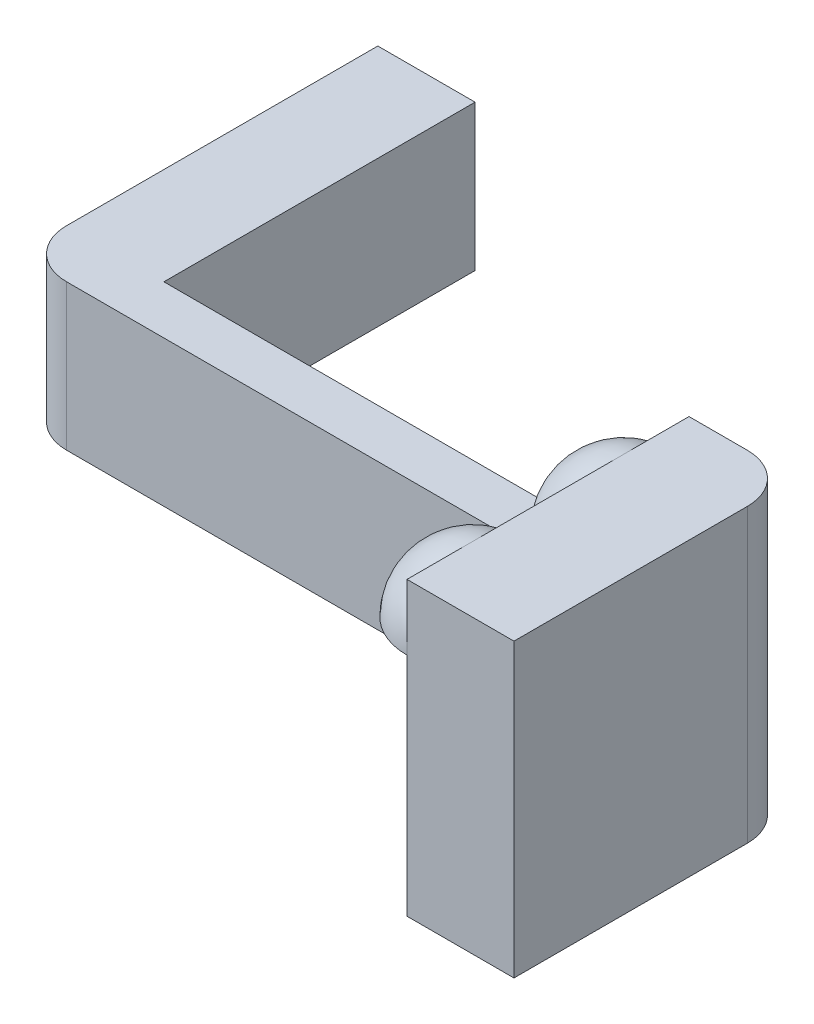
ISO-10303-21;
HEADER;
FILE_DESCRIPTION(('STEP AP214'),'2;1');
FILE_NAME('part.step','',(''),(''),'','','');
FILE_SCHEMA(('AUTOMOTIVE_DESIGN { 1 0 10303 214 1 1 1 1 }'));
ENDSEC;
DATA;
#1=APPLICATION_CONTEXT('core data for automotive mechanical design processes');
#2=APPLICATION_PROTOCOL_DEFINITION('international standard','automotive_design',2000,#1);
#3=PRODUCT_CONTEXT('',#1,'mechanical');
#4=PRODUCT('Part','Part','',(#3));
#5=PRODUCT_RELATED_PRODUCT_CATEGORY('part','',(#4));
#6=PRODUCT_DEFINITION_FORMATION('','',#4);
#7=PRODUCT_DEFINITION_CONTEXT('part definition',#1,'design');
#8=PRODUCT_DEFINITION('design','',#6,#7);
#9=PRODUCT_DEFINITION_SHAPE('','',#8);
#10=(LENGTH_UNIT() NAMED_UNIT(*) SI_UNIT(.MILLI.,.METRE.));
#11=(NAMED_UNIT(*) PLANE_ANGLE_UNIT() SI_UNIT($,.RADIAN.));
#12=(NAMED_UNIT(*) SI_UNIT($,.STERADIAN.) SOLID_ANGLE_UNIT());
#13=UNCERTAINTY_MEASURE_WITH_UNIT(LENGTH_MEASURE(1.E-05),#10,'distance_accuracy_value','');
#14=(GEOMETRIC_REPRESENTATION_CONTEXT(3) GLOBAL_UNCERTAINTY_ASSIGNED_CONTEXT((#13)) GLOBAL_UNIT_ASSIGNED_CONTEXT((#10,
#11,#12)) REPRESENTATION_CONTEXT('',''));
#15=CARTESIAN_POINT('',(0.,0.,0.));
#16=DIRECTION('',(0.,0.,1.));
#17=DIRECTION('',(1.,0.,0.));
#18=AXIS2_PLACEMENT_3D('',#15,#16,#17);
#19=CARTESIAN_POINT('',(24.,22.5,59.5941170815567));
#20=DIRECTION('',(1.,0.,0.));
#21=DIRECTION('',(0.,1.,0.));
#22=AXIS2_PLACEMENT_3D('',#19,#20,#21);
#23=PLANE('',#22);
#24=CARTESIAN_POINT('',(24.,15.75,6.75));
#25=DIRECTION('',(-1.,0.,0.));
#26=DIRECTION('',(0.,-1.,0.));
#27=AXIS2_PLACEMENT_3D('',#24,#25,#26);
#28=CIRCLE('',#27,6.75);
#29=CARTESIAN_POINT('',(24.,22.5,6.75));
#30=VERTEX_POINT('',#29);
#31=CARTESIAN_POINT('',(24.,15.75,0.));
#32=VERTEX_POINT('',#31);
#33=EDGE_CURVE('E196',#30,#32,#28,.T.);
#34=ORIENTED_EDGE('',*,*,#33,.F.);
#35=DIRECTION('',(0.,0.,-1.));
#36=VECTOR('',#35,1.);
#37=CARTESIAN_POINT('',(24.,22.5,59.5941170815567));
#38=LINE('',#37,#36);
#39=CARTESIAN_POINT('',(24.,22.5,0.));
#40=VERTEX_POINT('',#39);
#41=EDGE_CURVE('E330',#30,#40,#38,.T.);
#42=ORIENTED_EDGE('',*,*,#41,.T.);
#43=DIRECTION('',(0.,-1.,0.));
#44=VECTOR('',#43,1.);
#45=CARTESIAN_POINT('',(24.,22.5,0.));
#46=LINE('',#45,#44);
#47=EDGE_CURVE('E316',#40,#32,#46,.T.);
#48=ORIENTED_EDGE('',*,*,#47,.T.);
#49=EDGE_LOOP('',(#34,#42,#48));
#50=FACE_BOUND('',#49,.T.);
#51=ADVANCED_FACE('F45',(#50),#23,.F.);
#52=CARTESIAN_POINT('',(24.,15.75,13.5));
#53=VERTEX_POINT('',#52);
#54=EDGE_CURVE('E194',#53,#30,#28,.T.);
#55=ORIENTED_EDGE('',*,*,#54,.F.);
#56=DIRECTION('',(0.,0.,1.));
#57=VECTOR('',#56,1.);
#58=CARTESIAN_POINT('',(24.,15.75,0.));
#59=LINE('',#58,#57);
#60=EDGE_CURVE('E199',#32,#53,#59,.T.);
#61=ORIENTED_EDGE('',*,*,#60,.F.);
#62=CARTESIAN_POINT('',(24.,7.5,0.));
#63=VERTEX_POINT('',#62);
#64=EDGE_CURVE('E315',#32,#63,#46,.T.);
#65=ORIENTED_EDGE('',*,*,#64,.T.);
#66=DIRECTION('',(0.,0.,1.));
#67=VECTOR('',#66,1.);
#68=CARTESIAN_POINT('',(24.,7.5,5.));
#69=LINE('',#68,#67);
#70=CARTESIAN_POINT('',(24.,7.5,5.));
#71=VERTEX_POINT('',#70);
#72=EDGE_CURVE('E337',#63,#71,#69,.T.);
#73=ORIENTED_EDGE('',*,*,#72,.T.);
#74=DIRECTION('',(0.,-1.,0.));
#75=VECTOR('',#74,1.);
#76=CARTESIAN_POINT('',(24.,0.,5.));
#77=LINE('',#76,#75);
#78=CARTESIAN_POINT('',(24.,-7.5,5.00000000000001));
#79=VERTEX_POINT('',#78);
#80=EDGE_CURVE('E325',#71,#79,#77,.T.);
#81=ORIENTED_EDGE('',*,*,#80,.T.);
#82=DIRECTION('',(0.,0.,-1.));
#83=VECTOR('',#82,1.);
#84=CARTESIAN_POINT('',(24.,-7.5,59.5941170815567));
#85=LINE('',#84,#83);
#86=CARTESIAN_POINT('',(24.,-7.5,29.));
#87=VERTEX_POINT('',#86);
#88=EDGE_CURVE('E320',#87,#79,#85,.T.);
#89=ORIENTED_EDGE('',*,*,#88,.F.);
#90=DIRECTION('',(0.,1.,0.));
#91=VECTOR('',#90,1.);
#92=CARTESIAN_POINT('',(24.,22.5,29.));
#93=LINE('',#92,#91);
#94=CARTESIAN_POINT('',(24.,15.75,29.));
#95=VERTEX_POINT('',#94);
#96=EDGE_CURVE('E321',#87,#95,#93,.T.);
#97=ORIENTED_EDGE('',*,*,#96,.T.);
#98=DIRECTION('',(0.,0.,1.));
#99=VECTOR('',#98,1.);
#100=CARTESIAN_POINT('',(24.,15.75,0.));
#101=LINE('',#100,#99);
#102=CARTESIAN_POINT('',(24.,15.75,15.5));
#103=VERTEX_POINT('',#102);
#104=EDGE_CURVE('E216',#103,#95,#101,.T.);
#105=ORIENTED_EDGE('',*,*,#104,.F.);
#106=CARTESIAN_POINT('',(24.,15.75,22.25));
#107=DIRECTION('',(1.,0.,0.));
#108=DIRECTION('',(0.,1.,0.));
#109=AXIS2_PLACEMENT_3D('',#106,#107,#108);
#110=CIRCLE('',#109,6.75);
#111=CARTESIAN_POINT('',(24.,22.5,22.25));
#112=VERTEX_POINT('',#111);
#113=EDGE_CURVE('E11',#112,#103,#110,.F.);
#114=ORIENTED_EDGE('',*,*,#113,.F.);
#115=EDGE_CURVE('E210',#112,#30,#38,.T.);
#116=ORIENTED_EDGE('',*,*,#115,.T.);
#117=EDGE_LOOP('',(#55,#61,#65,#73,#81,#89,#97,#105,#114,#116));
#118=FACE_BOUND('',#117,.T.);
#119=ADVANCED_FACE('F207',(#118),#23,.F.);
#120=CARTESIAN_POINT('',(24.,15.75,22.25));
#121=DIRECTION('',(-1.,0.,0.));
#122=DIRECTION('',(0.,-1.,0.));
#123=AXIS2_PLACEMENT_3D('',#120,#121,#122);
#124=CIRCLE('',#123,6.75);
#125=EDGE_CURVE('E212',#95,#112,#124,.T.);
#126=ORIENTED_EDGE('',*,*,#125,.F.);
#127=CARTESIAN_POINT('',(24.,22.5,29.));
#128=VERTEX_POINT('',#127);
#129=EDGE_CURVE('E326',#95,#128,#93,.T.);
#130=ORIENTED_EDGE('',*,*,#129,.T.);
#131=EDGE_CURVE('E331',#128,#112,#38,.T.);
#132=ORIENTED_EDGE('',*,*,#131,.T.);
#133=EDGE_LOOP('',(#126,#130,#132));
#134=FACE_BOUND('',#133,.T.);
#135=ADVANCED_FACE('F485',(#134),#23,.F.);
#136=CARTESIAN_POINT('',(30.,7.5,5.));
#137=DIRECTION('',(0.,-1.,0.));
#138=DIRECTION('',(1.,0.,0.));
#139=AXIS2_PLACEMENT_3D('',#136,#137,#138);
#140=PLANE('',#139);
#141=ORIENTED_EDGE('',*,*,#72,.F.);
#142=DIRECTION('',(-1.,0.,0.));
#143=VECTOR('',#142,1.);
#144=CARTESIAN_POINT('',(30.,7.5,0.));
#145=LINE('',#144,#143);
#146=CARTESIAN_POINT('',(-30.,7.5,0.));
#147=VERTEX_POINT('',#146);
#148=EDGE_CURVE('E395',#63,#147,#145,.T.);
#149=ORIENTED_EDGE('',*,*,#148,.T.);
#150=DIRECTION('',(0.,0.,-1.));
#151=VECTOR('',#150,1.);
#152=CARTESIAN_POINT('',(-30.,7.5,5.));
#153=LINE('',#152,#151);
#154=CARTESIAN_POINT('',(-30.,7.49999999999999,-32.));
#155=VERTEX_POINT('',#154);
#156=EDGE_CURVE('E361',#147,#155,#153,.T.);
#157=ORIENTED_EDGE('',*,*,#156,.T.);
#158=DIRECTION('',(1.,0.,0.));
#159=VECTOR('',#158,1.);
#160=CARTESIAN_POINT('',(-40.,7.49999999999999,-32.));
#161=LINE('',#160,#159);
#162=CARTESIAN_POINT('',(-40.,7.49999999999999,-32.));
#163=VERTEX_POINT('',#162);
#164=EDGE_CURVE('E385',#163,#155,#161,.T.);
#165=ORIENTED_EDGE('',*,*,#164,.F.);
#166=DIRECTION('',(0.,0.,-1.));
#167=VECTOR('',#166,1.);
#168=CARTESIAN_POINT('',(-40.,7.5,5.));
#169=LINE('',#168,#167);
#170=CARTESIAN_POINT('',(-40.,7.5,0.));
#171=VERTEX_POINT('',#170);
#172=EDGE_CURVE('E362',#171,#163,#169,.T.);
#173=ORIENTED_EDGE('',*,*,#172,.F.);
#174=CARTESIAN_POINT('',(-35.,7.5,0.));
#175=DIRECTION('',(0.,-1.,0.));
#176=DIRECTION('',(1.,0.,0.));
#177=AXIS2_PLACEMENT_3D('',#174,#175,#176);
#178=CIRCLE('',#177,5.);
#179=CARTESIAN_POINT('',(-35.,7.5,5.));
#180=VERTEX_POINT('',#179);
#181=EDGE_CURVE('E410',#171,#180,#178,.F.);
#182=ORIENTED_EDGE('',*,*,#181,.T.);
#183=DIRECTION('',(-1.,0.,0.));
#184=VECTOR('',#183,1.);
#185=CARTESIAN_POINT('',(30.,7.5,5.));
#186=LINE('',#185,#184);
#187=EDGE_CURVE('E394',#71,#180,#186,.T.);
#188=ORIENTED_EDGE('',*,*,#187,.F.);
#189=EDGE_LOOP('',(#141,#149,#157,#165,#173,#182,#188));
#190=FACE_BOUND('',#189,.T.);
#191=ADVANCED_FACE('F509',(#190),#140,.F.);
#192=CARTESIAN_POINT('',(0.,0.,5.));
#193=DIRECTION('',(0.,0.,-1.));
#194=DIRECTION('',(-1.,0.,0.));
#195=AXIS2_PLACEMENT_3D('',#192,#193,#194);
#196=PLANE('',#195);
#197=ORIENTED_EDGE('',*,*,#80,.F.);
#198=ORIENTED_EDGE('',*,*,#187,.T.);
#199=DIRECTION('',(0.,1.,0.));
#200=VECTOR('',#199,1.);
#201=CARTESIAN_POINT('',(-35.,0.,5.));
#202=LINE('',#201,#200);
#203=CARTESIAN_POINT('',(-35.,-7.5,5.));
#204=VERTEX_POINT('',#203);
#205=EDGE_CURVE('E414',#180,#204,#202,.F.);
#206=ORIENTED_EDGE('',*,*,#205,.T.);
#207=DIRECTION('',(1.,0.,0.));
#208=VECTOR('',#207,1.);
#209=CARTESIAN_POINT('',(30.,-7.5,5.));
#210=LINE('',#209,#208);
#211=EDGE_CURVE('E390',#204,#79,#210,.T.);
#212=ORIENTED_EDGE('',*,*,#211,.T.);
#213=EDGE_LOOP('',(#197,#198,#206,#212));
#214=FACE_BOUND('',#213,.T.);
#215=ADVANCED_FACE('F454',(#214),#196,.F.);
#216=CARTESIAN_POINT('',(30.,-7.5,5.));
#217=DIRECTION('',(0.,1.,0.));
#218=DIRECTION('',(-1.,0.,0.));
#219=AXIS2_PLACEMENT_3D('',#216,#217,#218);
#220=PLANE('',#219);
#221=DIRECTION('',(1.,0.,0.));
#222=VECTOR('',#221,1.);
#223=CARTESIAN_POINT('',(33.,-7.5,5.));
#224=LINE('',#223,#222);
#225=CARTESIAN_POINT('',(27.,-7.5,5.));
#226=VERTEX_POINT('',#225);
#227=CARTESIAN_POINT('',(33.,-7.5,5.));
#228=VERTEX_POINT('',#227);
#229=EDGE_CURVE('E245',#226,#228,#224,.T.);
#230=ORIENTED_EDGE('',*,*,#229,.F.);
#231=DIRECTION('',(0.,0.,-1.));
#232=VECTOR('',#231,1.);
#233=CARTESIAN_POINT('',(27.,-7.5,27.));
#234=LINE('',#233,#232);
#235=CARTESIAN_POINT('',(27.,-7.5,27.));
#236=VERTEX_POINT('',#235);
#237=EDGE_CURVE('E242',#236,#226,#234,.T.);
#238=ORIENTED_EDGE('',*,*,#237,.F.);
#239=DIRECTION('',(-1.,0.,0.));
#240=VECTOR('',#239,1.);
#241=CARTESIAN_POINT('',(33.,-7.5,27.));
#242=LINE('',#241,#240);
#243=CARTESIAN_POINT('',(33.,-7.5,27.));
#244=VERTEX_POINT('',#243);
#245=EDGE_CURVE('E229',#244,#236,#242,.T.);
#246=ORIENTED_EDGE('',*,*,#245,.F.);
#247=DIRECTION('',(0.,0.,1.));
#248=VECTOR('',#247,1.);
#249=CARTESIAN_POINT('',(33.,-7.5,27.));
#250=LINE('',#249,#248);
#251=EDGE_CURVE('E250',#228,#244,#250,.T.);
#252=ORIENTED_EDGE('',*,*,#251,.F.);
#253=EDGE_LOOP('',(#230,#238,#246,#252));
#254=FACE_BOUND('',#253,.T.);
#255=DIRECTION('',(1.,0.,0.));
#256=VECTOR('',#255,1.);
#257=CARTESIAN_POINT('',(-32.,-7.5,-27.));
#258=LINE('',#257,#256);
#259=CARTESIAN_POINT('',(-38.,-7.5,-27.));
#260=VERTEX_POINT('',#259);
#261=CARTESIAN_POINT('',(-32.,-7.5,-27.));
#262=VERTEX_POINT('',#261);
#263=EDGE_CURVE('E292',#260,#262,#258,.T.);
#264=ORIENTED_EDGE('',*,*,#263,.F.);
#265=DIRECTION('',(0.,0.,-1.));
#266=VECTOR('',#265,1.);
#267=CARTESIAN_POINT('',(-38.,-7.5,-5.));
#268=LINE('',#267,#266);
#269=CARTESIAN_POINT('',(-38.,-7.5,-5.));
#270=VERTEX_POINT('',#269);
#271=EDGE_CURVE('E246',#270,#260,#268,.T.);
#272=ORIENTED_EDGE('',*,*,#271,.F.);
#273=DIRECTION('',(-1.,0.,0.));
#274=VECTOR('',#273,1.);
#275=CARTESIAN_POINT('',(-32.,-7.5,-5.));
#276=LINE('',#275,#274);
#277=CARTESIAN_POINT('',(-32.,-7.5,-5.));
#278=VERTEX_POINT('',#277);
#279=EDGE_CURVE('E283',#278,#270,#276,.T.);
#280=ORIENTED_EDGE('',*,*,#279,.F.);
#281=DIRECTION('',(0.,0.,1.));
#282=VECTOR('',#281,1.);
#283=CARTESIAN_POINT('',(-32.,-7.5,-5.));
#284=LINE('',#283,#282);
#285=EDGE_CURVE('E287',#262,#278,#284,.T.);
#286=ORIENTED_EDGE('',*,*,#285,.F.);
#287=EDGE_LOOP('',(#264,#272,#280,#286));
#288=FACE_BOUND('',#287,.T.);
#289=DIRECTION('',(1.,0.,0.));
#290=VECTOR('',#289,1.);
#291=CARTESIAN_POINT('',(30.,-7.5,0.));
#292=LINE('',#291,#290);
#293=CARTESIAN_POINT('',(-30.,-7.50000000000001,0.));
#294=VERTEX_POINT('',#293);
#295=CARTESIAN_POINT('',(30.,-7.5,0.));
#296=VERTEX_POINT('',#295);
#297=EDGE_CURVE('E402',#294,#296,#292,.T.);
#298=ORIENTED_EDGE('',*,*,#297,.T.);
#299=CARTESIAN_POINT('',(30.,-7.5,5.));
#300=DIRECTION('',(0.,1.,0.));
#301=DIRECTION('',(-1.,0.,0.));
#302=AXIS2_PLACEMENT_3D('',#299,#300,#301);
#303=CIRCLE('',#302,5.);
#304=CARTESIAN_POINT('',(35.,-7.5,5.));
#305=VERTEX_POINT('',#304);
#306=EDGE_CURVE('E54',#296,#305,#303,.F.);
#307=ORIENTED_EDGE('',*,*,#306,.T.);
#308=DIRECTION('',(0.,0.,-1.));
#309=VECTOR('',#308,1.);
#310=CARTESIAN_POINT('',(35.,-7.5,0.));
#311=LINE('',#310,#309);
#312=CARTESIAN_POINT('',(35.,-7.50000000000001,29.));
#313=VERTEX_POINT('',#312);
#314=EDGE_CURVE('E347',#313,#305,#311,.T.);
#315=ORIENTED_EDGE('',*,*,#314,.F.);
#316=DIRECTION('',(-1.,0.,0.));
#317=VECTOR('',#316,1.);
#318=CARTESIAN_POINT('',(35.,-7.50000000000001,29.));
#319=LINE('',#318,#317);
#320=EDGE_CURVE('E351',#313,#87,#319,.T.);
#321=ORIENTED_EDGE('',*,*,#320,.T.);
#322=ORIENTED_EDGE('',*,*,#88,.T.);
#323=ORIENTED_EDGE('',*,*,#211,.F.);
#324=CARTESIAN_POINT('',(-35.,-7.5,0.));
#325=DIRECTION('',(0.,1.,0.));
#326=DIRECTION('',(-1.,0.,0.));
#327=AXIS2_PLACEMENT_3D('',#324,#325,#326);
#328=CIRCLE('',#327,5.);
#329=CARTESIAN_POINT('',(-40.,-7.50000000000001,0.));
#330=VERTEX_POINT('',#329);
#331=EDGE_CURVE('E417',#204,#330,#328,.F.);
#332=ORIENTED_EDGE('',*,*,#331,.T.);
#333=DIRECTION('',(0.,0.,1.));
#334=VECTOR('',#333,1.);
#335=CARTESIAN_POINT('',(-40.,-7.50000000000001,5.));
#336=LINE('',#335,#334);
#337=CARTESIAN_POINT('',(-40.,-7.50000000000001,-32.));
#338=VERTEX_POINT('',#337);
#339=EDGE_CURVE('E369',#338,#330,#336,.T.);
#340=ORIENTED_EDGE('',*,*,#339,.F.);
#341=DIRECTION('',(1.,0.,0.));
#342=VECTOR('',#341,1.);
#343=CARTESIAN_POINT('',(-40.,-7.50000000000001,-32.));
#344=LINE('',#343,#342);
#345=CARTESIAN_POINT('',(-30.,-7.50000000000001,-32.));
#346=VERTEX_POINT('',#345);
#347=EDGE_CURVE('E373',#338,#346,#344,.T.);
#348=ORIENTED_EDGE('',*,*,#347,.T.);
#349=DIRECTION('',(0.,0.,1.));
#350=VECTOR('',#349,1.);
#351=CARTESIAN_POINT('',(-30.,-7.50000000000001,5.));
#352=LINE('',#351,#350);
#353=EDGE_CURVE('E366',#346,#294,#352,.T.);
#354=ORIENTED_EDGE('',*,*,#353,.T.);
#355=EDGE_LOOP('',(#298,#307,#315,#321,#322,#323,#332,#340,#348,#354));
#356=FACE_BOUND('',#355,.T.);
#357=ADVANCED_FACE('F431',(#254,#288,#356),#220,.F.);
#358=CARTESIAN_POINT('',(0.,0.,0.));
#359=DIRECTION('',(0.,0.,-1.));
#360=DIRECTION('',(-1.,0.,0.));
#361=AXIS2_PLACEMENT_3D('',#358,#359,#360);
#362=PLANE('',#361);
#363=DIRECTION('',(0.,1.,0.));
#364=VECTOR('',#363,1.);
#365=CARTESIAN_POINT('',(30.,22.5,0.));
#366=LINE('',#365,#364);
#367=CARTESIAN_POINT('',(30.,22.5,0.));
#368=VERTEX_POINT('',#367);
#369=EDGE_CURVE('E340',#296,#368,#366,.T.);
#370=ORIENTED_EDGE('',*,*,#369,.F.);
#371=ORIENTED_EDGE('',*,*,#297,.F.);
#372=DIRECTION('',(0.,-1.,0.));
#373=VECTOR('',#372,1.);
#374=CARTESIAN_POINT('',(-30.,7.5,0.));
#375=LINE('',#374,#373);
#376=EDGE_CURVE('E389',#147,#294,#375,.T.);
#377=ORIENTED_EDGE('',*,*,#376,.F.);
#378=ORIENTED_EDGE('',*,*,#148,.F.);
#379=ORIENTED_EDGE('',*,*,#64,.F.);
#380=ORIENTED_EDGE('',*,*,#47,.F.);
#381=DIRECTION('',(-1.,0.,0.));
#382=VECTOR('',#381,1.);
#383=CARTESIAN_POINT('',(30.,22.5,0.));
#384=LINE('',#383,#382);
#385=EDGE_CURVE('E260',#368,#40,#384,.T.);
#386=ORIENTED_EDGE('',*,*,#385,.F.);
#387=EDGE_LOOP('',(#370,#371,#377,#378,#379,#380,#386));
#388=FACE_BOUND('',#387,.T.);
#389=ADVANCED_FACE('F477',(#388),#362,.T.);
#390=CARTESIAN_POINT('',(-40.,7.49999999999999,-32.));
#391=DIRECTION('',(0.,0.,1.));
#392=DIRECTION('',(1.,0.,0.));
#393=AXIS2_PLACEMENT_3D('',#390,#391,#392);
#394=PLANE('',#393);
#395=DIRECTION('',(0.,-1.,0.));
#396=VECTOR('',#395,1.);
#397=CARTESIAN_POINT('',(-30.,7.49999999999999,-32.));
#398=LINE('',#397,#396);
#399=EDGE_CURVE('E376',#155,#346,#398,.T.);
#400=ORIENTED_EDGE('',*,*,#399,.T.);
#401=ORIENTED_EDGE('',*,*,#347,.F.);
#402=DIRECTION('',(0.,-1.,0.));
#403=VECTOR('',#402,1.);
#404=CARTESIAN_POINT('',(-40.,7.49999999999999,-32.));
#405=LINE('',#404,#403);
#406=EDGE_CURVE('E365',#163,#338,#405,.T.);
#407=ORIENTED_EDGE('',*,*,#406,.F.);
#408=ORIENTED_EDGE('',*,*,#164,.T.);
#409=EDGE_LOOP('',(#400,#401,#407,#408));
#410=FACE_BOUND('',#409,.T.);
#411=ADVANCED_FACE('F468',(#410),#394,.F.);
#412=CARTESIAN_POINT('',(-40.,0.,0.));
#413=DIRECTION('',(1.,0.,0.));
#414=DIRECTION('',(0.,0.,-1.));
#415=AXIS2_PLACEMENT_3D('',#412,#413,#414);
#416=PLANE('',#415);
#417=ORIENTED_EDGE('',*,*,#339,.T.);
#418=DIRECTION('',(0.,1.,0.));
#419=VECTOR('',#418,1.);
#420=CARTESIAN_POINT('',(-40.,0.,0.));
#421=LINE('',#420,#419);
#422=EDGE_CURVE('E398',#330,#171,#421,.T.);
#423=ORIENTED_EDGE('',*,*,#422,.T.);
#424=ORIENTED_EDGE('',*,*,#172,.T.);
#425=ORIENTED_EDGE('',*,*,#406,.T.);
#426=EDGE_LOOP('',(#417,#423,#424,#425));
#427=FACE_BOUND('',#426,.T.);
#428=ADVANCED_FACE('F462',(#427),#416,.F.);
#429=CARTESIAN_POINT('',(-30.,0.,0.));
#430=DIRECTION('',(1.,0.,0.));
#431=DIRECTION('',(0.,0.,-1.));
#432=AXIS2_PLACEMENT_3D('',#429,#430,#431);
#433=PLANE('',#432);
#434=ORIENTED_EDGE('',*,*,#156,.F.);
#435=ORIENTED_EDGE('',*,*,#376,.T.);
#436=ORIENTED_EDGE('',*,*,#353,.F.);
#437=ORIENTED_EDGE('',*,*,#399,.F.);
#438=EDGE_LOOP('',(#434,#435,#436,#437));
#439=FACE_BOUND('',#438,.T.);
#440=ADVANCED_FACE('F473',(#439),#433,.T.);
#441=CARTESIAN_POINT('',(-35.,0.,0.));
#442=DIRECTION('',(0.,1.,0.));
#443=DIRECTION('',(0.,0.,1.));
#444=AXIS2_PLACEMENT_3D('',#441,#442,#443);
#445=CYLINDRICAL_SURFACE('',#444,5.);
#446=ORIENTED_EDGE('',*,*,#331,.F.);
#447=ORIENTED_EDGE('',*,*,#205,.F.);
#448=ORIENTED_EDGE('',*,*,#181,.F.);
#449=ORIENTED_EDGE('',*,*,#422,.F.);
#450=EDGE_LOOP('',(#446,#447,#448,#449));
#451=FACE_BOUND('',#450,.T.);
#452=ADVANCED_FACE('F458',(#451),#445,.T.);
#453=CARTESIAN_POINT('',(35.,22.5,0.));
#454=DIRECTION('',(0.,-1.,0.));
#455=DIRECTION('',(0.,0.,-1.));
#456=AXIS2_PLACEMENT_3D('',#453,#454,#455);
#457=PLANE('',#456);
#458=DIRECTION('',(0.,0.,1.));
#459=VECTOR('',#458,1.);
#460=CARTESIAN_POINT('',(35.,22.5,0.));
#461=LINE('',#460,#459);
#462=CARTESIAN_POINT('',(35.,22.5,5.));
#463=VERTEX_POINT('',#462);
#464=CARTESIAN_POINT('',(35.,22.5,29.));
#465=VERTEX_POINT('',#464);
#466=EDGE_CURVE('E341',#463,#465,#461,.T.);
#467=ORIENTED_EDGE('',*,*,#466,.F.);
#468=CARTESIAN_POINT('',(30.,22.5,5.));
#469=DIRECTION('',(0.,-1.,0.));
#470=DIRECTION('',(0.,0.,-1.));
#471=AXIS2_PLACEMENT_3D('',#468,#469,#470);
#472=CIRCLE('',#471,5.);
#473=EDGE_CURVE('E424',#463,#368,#472,.F.);
#474=ORIENTED_EDGE('',*,*,#473,.T.);
#475=ORIENTED_EDGE('',*,*,#385,.T.);
#476=ORIENTED_EDGE('',*,*,#41,.F.);
#477=ORIENTED_EDGE('',*,*,#115,.F.);
#478=ORIENTED_EDGE('',*,*,#131,.F.);
#479=DIRECTION('',(-1.,0.,0.));
#480=VECTOR('',#479,1.);
#481=CARTESIAN_POINT('',(35.,22.5,29.));
#482=LINE('',#481,#480);
#483=EDGE_CURVE('E357',#465,#128,#482,.T.);
#484=ORIENTED_EDGE('',*,*,#483,.F.);
#485=EDGE_LOOP('',(#467,#474,#475,#476,#477,#478,#484));
#486=FACE_BOUND('',#485,.T.);
#487=ADVANCED_FACE('F441',(#486),#457,.F.);
#488=CARTESIAN_POINT('',(35.,22.5,29.));
#489=DIRECTION('',(0.,0.,-1.));
#490=DIRECTION('',(0.,1.,0.));
#491=AXIS2_PLACEMENT_3D('',#488,#489,#490);
#492=PLANE('',#491);
#493=ORIENTED_EDGE('',*,*,#483,.T.);
#494=ORIENTED_EDGE('',*,*,#129,.F.);
#495=ORIENTED_EDGE('',*,*,#96,.F.);
#496=ORIENTED_EDGE('',*,*,#320,.F.);
#497=DIRECTION('',(0.,-1.,0.));
#498=VECTOR('',#497,1.);
#499=CARTESIAN_POINT('',(35.,22.5,29.));
#500=LINE('',#499,#498);
#501=EDGE_CURVE('E344',#465,#313,#500,.T.);
#502=ORIENTED_EDGE('',*,*,#501,.F.);
#503=EDGE_LOOP('',(#493,#494,#495,#496,#502));
#504=FACE_BOUND('',#503,.T.);
#505=ADVANCED_FACE('F447',(#504),#492,.F.);
#506=CARTESIAN_POINT('',(35.,0.,0.));
#507=DIRECTION('',(-1.,0.,0.));
#508=DIRECTION('',(0.,0.,1.));
#509=AXIS2_PLACEMENT_3D('',#506,#507,#508);
#510=PLANE('',#509);
#511=ORIENTED_EDGE('',*,*,#314,.T.);
#512=DIRECTION('',(0.,1.,0.));
#513=VECTOR('',#512,1.);
#514=CARTESIAN_POINT('',(35.,22.5,5.));
#515=LINE('',#514,#513);
#516=EDGE_CURVE('E420',#305,#463,#515,.T.);
#517=ORIENTED_EDGE('',*,*,#516,.T.);
#518=ORIENTED_EDGE('',*,*,#466,.T.);
#519=ORIENTED_EDGE('',*,*,#501,.T.);
#520=EDGE_LOOP('',(#511,#517,#518,#519));
#521=FACE_BOUND('',#520,.T.);
#522=ADVANCED_FACE('F436',(#521),#510,.F.);
#523=CARTESIAN_POINT('',(30.,0.,5.));
#524=DIRECTION('',(0.,-1.,0.));
#525=DIRECTION('',(0.,0.,-1.));
#526=AXIS2_PLACEMENT_3D('',#523,#524,#525);
#527=CYLINDRICAL_SURFACE('',#526,5.);
#528=ORIENTED_EDGE('',*,*,#306,.F.);
#529=ORIENTED_EDGE('',*,*,#369,.T.);
#530=ORIENTED_EDGE('',*,*,#473,.F.);
#531=ORIENTED_EDGE('',*,*,#516,.F.);
#532=EDGE_LOOP('',(#528,#529,#530,#531));
#533=FACE_BOUND('',#532,.T.);
#534=ADVANCED_FACE('F47',(#533),#527,.T.);
#535=CARTESIAN_POINT('',(-38.,3.5,-5.));
#536=DIRECTION('',(-1.,0.,0.));
#537=DIRECTION('',(0.,-1.,0.));
#538=AXIS2_PLACEMENT_3D('',#535,#536,#537);
#539=PLANE('',#538);
#540=ORIENTED_EDGE('',*,*,#271,.T.);
#541=DIRECTION('',(0.,-1.,0.));
#542=VECTOR('',#541,1.);
#543=CARTESIAN_POINT('',(-38.,3.5,-27.));
#544=LINE('',#543,#542);
#545=CARTESIAN_POINT('',(-38.,3.5,-27.));
#546=VERTEX_POINT('',#545);
#547=EDGE_CURVE('E270',#546,#260,#544,.T.);
#548=ORIENTED_EDGE('',*,*,#547,.F.);
#549=DIRECTION('',(0.,0.,-1.));
#550=VECTOR('',#549,1.);
#551=CARTESIAN_POINT('',(-38.,3.5,-5.));
#552=LINE('',#551,#550);
#553=CARTESIAN_POINT('',(-38.,3.5,-5.));
#554=VERTEX_POINT('',#553);
#555=EDGE_CURVE('E288',#554,#546,#552,.T.);
#556=ORIENTED_EDGE('',*,*,#555,.F.);
#557=DIRECTION('',(0.,-1.,0.));
#558=VECTOR('',#557,1.);
#559=CARTESIAN_POINT('',(-38.,3.5,-5.));
#560=LINE('',#559,#558);
#561=EDGE_CURVE('E223',#554,#270,#560,.T.);
#562=ORIENTED_EDGE('',*,*,#561,.T.);
#563=EDGE_LOOP('',(#540,#548,#556,#562));
#564=FACE_BOUND('',#563,.T.);
#565=ADVANCED_FACE('F564',(#564),#539,.F.);
#566=CARTESIAN_POINT('',(-32.,3.5,-5.));
#567=DIRECTION('',(0.,0.,1.));
#568=DIRECTION('',(1.,0.,0.));
#569=AXIS2_PLACEMENT_3D('',#566,#567,#568);
#570=PLANE('',#569);
#571=ORIENTED_EDGE('',*,*,#279,.T.);
#572=ORIENTED_EDGE('',*,*,#561,.F.);
#573=DIRECTION('',(-1.,0.,0.));
#574=VECTOR('',#573,1.);
#575=CARTESIAN_POINT('',(-32.,3.5,-5.));
#576=LINE('',#575,#574);
#577=CARTESIAN_POINT('',(-32.,3.5,-5.));
#578=VERTEX_POINT('',#577);
#579=EDGE_CURVE('E274',#578,#554,#576,.T.);
#580=ORIENTED_EDGE('',*,*,#579,.F.);
#581=DIRECTION('',(0.,-1.,0.));
#582=VECTOR('',#581,1.);
#583=CARTESIAN_POINT('',(-32.,3.5,-5.));
#584=LINE('',#583,#582);
#585=EDGE_CURVE('E278',#578,#278,#584,.T.);
#586=ORIENTED_EDGE('',*,*,#585,.T.);
#587=EDGE_LOOP('',(#571,#572,#580,#586));
#588=FACE_BOUND('',#587,.T.);
#589=ADVANCED_FACE('F576',(#588),#570,.F.);
#590=CARTESIAN_POINT('',(-32.,3.5,-5.));
#591=DIRECTION('',(1.,0.,0.));
#592=DIRECTION('',(0.,1.,0.));
#593=AXIS2_PLACEMENT_3D('',#590,#591,#592);
#594=PLANE('',#593);
#595=ORIENTED_EDGE('',*,*,#285,.T.);
#596=ORIENTED_EDGE('',*,*,#585,.F.);
#597=DIRECTION('',(0.,0.,1.));
#598=VECTOR('',#597,1.);
#599=CARTESIAN_POINT('',(-32.,3.5,-5.));
#600=LINE('',#599,#598);
#601=CARTESIAN_POINT('',(-32.,3.5,-27.));
#602=VERTEX_POINT('',#601);
#603=EDGE_CURVE('E301',#602,#578,#600,.T.);
#604=ORIENTED_EDGE('',*,*,#603,.F.);
#605=DIRECTION('',(0.,-1.,0.));
#606=VECTOR('',#605,1.);
#607=CARTESIAN_POINT('',(-32.,3.5,-27.));
#608=LINE('',#607,#606);
#609=EDGE_CURVE('E275',#602,#262,#608,.T.);
#610=ORIENTED_EDGE('',*,*,#609,.T.);
#611=EDGE_LOOP('',(#595,#596,#604,#610));
#612=FACE_BOUND('',#611,.T.);
#613=ADVANCED_FACE('F584',(#612),#594,.F.);
#614=CARTESIAN_POINT('',(-32.,3.5,-27.));
#615=DIRECTION('',(0.,0.,-1.));
#616=DIRECTION('',(-1.,0.,0.));
#617=AXIS2_PLACEMENT_3D('',#614,#615,#616);
#618=PLANE('',#617);
#619=ORIENTED_EDGE('',*,*,#263,.T.);
#620=ORIENTED_EDGE('',*,*,#609,.F.);
#621=DIRECTION('',(1.,0.,0.));
#622=VECTOR('',#621,1.);
#623=CARTESIAN_POINT('',(-32.,3.5,-27.));
#624=LINE('',#623,#622);
#625=EDGE_CURVE('E305',#546,#602,#624,.T.);
#626=ORIENTED_EDGE('',*,*,#625,.F.);
#627=ORIENTED_EDGE('',*,*,#547,.T.);
#628=EDGE_LOOP('',(#619,#620,#626,#627));
#629=FACE_BOUND('',#628,.T.);
#630=ADVANCED_FACE('F592',(#629),#618,.F.);
#631=CARTESIAN_POINT('',(0.,3.5,0.));
#632=DIRECTION('',(0.,1.,0.));
#633=DIRECTION('',(-1.,0.,0.));
#634=AXIS2_PLACEMENT_3D('',#631,#632,#633);
#635=PLANE('',#634);
#636=ORIENTED_EDGE('',*,*,#555,.T.);
#637=ORIENTED_EDGE('',*,*,#625,.T.);
#638=ORIENTED_EDGE('',*,*,#603,.T.);
#639=ORIENTED_EDGE('',*,*,#579,.T.);
#640=EDGE_LOOP('',(#636,#637,#638,#639));
#641=FACE_BOUND('',#640,.T.);
#642=ADVANCED_FACE('F600',(#641),#635,.F.);
#643=CARTESIAN_POINT('',(27.,3.5,27.));
#644=DIRECTION('',(-1.,0.,0.));
#645=DIRECTION('',(0.,-1.,0.));
#646=AXIS2_PLACEMENT_3D('',#643,#644,#645);
#647=PLANE('',#646);
#648=ORIENTED_EDGE('',*,*,#237,.T.);
#649=DIRECTION('',(0.,-1.,0.));
#650=VECTOR('',#649,1.);
#651=CARTESIAN_POINT('',(27.,3.5,5.));
#652=LINE('',#651,#650);
#653=CARTESIAN_POINT('',(27.,3.5,5.));
#654=VERTEX_POINT('',#653);
#655=EDGE_CURVE('E241',#654,#226,#652,.T.);
#656=ORIENTED_EDGE('',*,*,#655,.F.);
#657=DIRECTION('',(0.,0.,-1.));
#658=VECTOR('',#657,1.);
#659=CARTESIAN_POINT('',(27.,3.5,27.));
#660=LINE('',#659,#658);
#661=CARTESIAN_POINT('',(27.,3.5,27.));
#662=VERTEX_POINT('',#661);
#663=EDGE_CURVE('E224',#662,#654,#660,.T.);
#664=ORIENTED_EDGE('',*,*,#663,.F.);
#665=DIRECTION('',(0.,-1.,0.));
#666=VECTOR('',#665,1.);
#667=CARTESIAN_POINT('',(27.,3.5,27.));
#668=LINE('',#667,#666);
#669=EDGE_CURVE('E257',#662,#236,#668,.T.);
#670=ORIENTED_EDGE('',*,*,#669,.T.);
#671=EDGE_LOOP('',(#648,#656,#664,#670));
#672=FACE_BOUND('',#671,.T.);
#673=ADVANCED_FACE('F608',(#672),#647,.F.);
#674=CARTESIAN_POINT('',(33.,3.5,27.));
#675=DIRECTION('',(0.,0.,1.));
#676=DIRECTION('',(1.,0.,0.));
#677=AXIS2_PLACEMENT_3D('',#674,#675,#676);
#678=PLANE('',#677);
#679=ORIENTED_EDGE('',*,*,#245,.T.);
#680=ORIENTED_EDGE('',*,*,#669,.F.);
#681=DIRECTION('',(-1.,0.,0.));
#682=VECTOR('',#681,1.);
#683=CARTESIAN_POINT('',(33.,3.5,27.));
#684=LINE('',#683,#682);
#685=CARTESIAN_POINT('',(33.,3.5,27.));
#686=VERTEX_POINT('',#685);
#687=EDGE_CURVE('E237',#686,#662,#684,.T.);
#688=ORIENTED_EDGE('',*,*,#687,.F.);
#689=DIRECTION('',(0.,-1.,0.));
#690=VECTOR('',#689,1.);
#691=CARTESIAN_POINT('',(33.,3.5,27.));
#692=LINE('',#691,#690);
#693=EDGE_CURVE('E261',#686,#244,#692,.T.);
#694=ORIENTED_EDGE('',*,*,#693,.T.);
#695=EDGE_LOOP('',(#679,#680,#688,#694));
#696=FACE_BOUND('',#695,.T.);
#697=ADVANCED_FACE('F615',(#696),#678,.F.);
#698=CARTESIAN_POINT('',(33.,3.5,27.));
#699=DIRECTION('',(1.,0.,0.));
#700=DIRECTION('',(0.,0.,-1.));
#701=AXIS2_PLACEMENT_3D('',#698,#699,#700);
#702=PLANE('',#701);
#703=ORIENTED_EDGE('',*,*,#251,.T.);
#704=ORIENTED_EDGE('',*,*,#693,.F.);
#705=DIRECTION('',(0.,0.,1.));
#706=VECTOR('',#705,1.);
#707=CARTESIAN_POINT('',(33.,3.5,27.));
#708=LINE('',#707,#706);
#709=CARTESIAN_POINT('',(33.,3.5,5.));
#710=VERTEX_POINT('',#709);
#711=EDGE_CURVE('E233',#710,#686,#708,.T.);
#712=ORIENTED_EDGE('',*,*,#711,.F.);
#713=DIRECTION('',(0.,-1.,0.));
#714=VECTOR('',#713,1.);
#715=CARTESIAN_POINT('',(33.,3.5,5.));
#716=LINE('',#715,#714);
#717=EDGE_CURVE('E264',#710,#228,#716,.T.);
#718=ORIENTED_EDGE('',*,*,#717,.T.);
#719=EDGE_LOOP('',(#703,#704,#712,#718));
#720=FACE_BOUND('',#719,.T.);
#721=ADVANCED_FACE('F623',(#720),#702,.F.);
#722=CARTESIAN_POINT('',(33.,3.5,5.));
#723=DIRECTION('',(0.,0.,-1.));
#724=DIRECTION('',(-1.,0.,0.));
#725=AXIS2_PLACEMENT_3D('',#722,#723,#724);
#726=PLANE('',#725);
#727=ORIENTED_EDGE('',*,*,#229,.T.);
#728=ORIENTED_EDGE('',*,*,#717,.F.);
#729=DIRECTION('',(1.,0.,0.));
#730=VECTOR('',#729,1.);
#731=CARTESIAN_POINT('',(33.,3.5,5.));
#732=LINE('',#731,#730);
#733=EDGE_CURVE('E228',#654,#710,#732,.T.);
#734=ORIENTED_EDGE('',*,*,#733,.F.);
#735=ORIENTED_EDGE('',*,*,#655,.T.);
#736=EDGE_LOOP('',(#727,#728,#734,#735));
#737=FACE_BOUND('',#736,.T.);
#738=ADVANCED_FACE('F498',(#737),#726,.F.);
#739=CARTESIAN_POINT('',(0.,3.5,0.));
#740=DIRECTION('',(0.,1.,0.));
#741=DIRECTION('',(0.,0.,1.));
#742=AXIS2_PLACEMENT_3D('',#739,#740,#741);
#743=PLANE('',#742);
#744=ORIENTED_EDGE('',*,*,#663,.T.);
#745=ORIENTED_EDGE('',*,*,#733,.T.);
#746=ORIENTED_EDGE('',*,*,#711,.T.);
#747=ORIENTED_EDGE('',*,*,#687,.T.);
#748=EDGE_LOOP('',(#744,#745,#746,#747));
#749=FACE_BOUND('',#748,.T.);
#750=ADVANCED_FACE('F491',(#749),#743,.F.);
#751=CARTESIAN_POINT('',(24.,15.75,22.25));
#752=DIRECTION('',(0.,0.,-1.));
#753=DIRECTION('',(-1.,0.,0.));
#754=AXIS2_PLACEMENT_3D('',#751,#752,#753);
#755=SPHERICAL_SURFACE('',#754,6.75);
#756=CARTESIAN_POINT('',(24.,15.75,22.25));
#757=DIRECTION('',(0.,-1.,0.));
#758=DIRECTION('',(1.,0.,0.));
#759=AXIS2_PLACEMENT_3D('',#756,#757,#758);
#760=CIRCLE('',#759,6.75);
#761=EDGE_CURVE('E67',#95,#103,#760,.T.);
#762=ORIENTED_EDGE('',*,*,#761,.F.);
#763=ORIENTED_EDGE('',*,*,#125,.T.);
#764=ORIENTED_EDGE('',*,*,#113,.T.);
#765=EDGE_LOOP('',(#762,#763,#764));
#766=FACE_BOUND('',#765,.T.);
#767=ADVANCED_FACE('F489',(#766),#755,.T.);
#768=CARTESIAN_POINT('',(39.75,15.7500000000001,0.));
#769=DIRECTION('',(0.,-1.,0.));
#770=DIRECTION('',(1.,0.,0.));
#771=AXIS2_PLACEMENT_3D('',#768,#769,#770);
#772=PLANE('',#771);
#773=ORIENTED_EDGE('',*,*,#104,.T.);
#774=ORIENTED_EDGE('',*,*,#761,.T.);
#775=EDGE_LOOP('',(#773,#774));
#776=FACE_BOUND('',#775,.T.);
#777=ADVANCED_FACE('F487',(#776),#772,.T.);
#778=CARTESIAN_POINT('',(24.,15.75,6.75));
#779=DIRECTION('',(0.,0.,-1.));
#780=DIRECTION('',(-1.,0.,0.));
#781=AXIS2_PLACEMENT_3D('',#778,#779,#780);
#782=SPHERICAL_SURFACE('',#781,6.75);
#783=ORIENTED_EDGE('',*,*,#54,.T.);
#784=ORIENTED_EDGE('',*,*,#33,.T.);
#785=CARTESIAN_POINT('',(24.,15.75,6.75));
#786=DIRECTION('',(0.,-1.,0.));
#787=DIRECTION('',(1.,0.,0.));
#788=AXIS2_PLACEMENT_3D('',#785,#786,#787);
#789=CIRCLE('',#788,6.75);
#790=EDGE_CURVE('E60',#53,#32,#789,.T.);
#791=ORIENTED_EDGE('',*,*,#790,.F.);
#792=EDGE_LOOP('',(#783,#784,#791));
#793=FACE_BOUND('',#792,.T.);
#794=ADVANCED_FACE('F192',(#793),#782,.T.);
#795=CARTESIAN_POINT('',(24.,15.75,6.75));
#796=DIRECTION('',(0.,-1.,0.));
#797=DIRECTION('',(1.,0.,0.));
#798=AXIS2_PLACEMENT_3D('',#795,#796,#797);
#799=PLANE('',#798);
#800=ORIENTED_EDGE('',*,*,#790,.T.);
#801=ORIENTED_EDGE('',*,*,#60,.T.);
#802=EDGE_LOOP('',(#800,#801));
#803=FACE_BOUND('',#802,.T.);
#804=ADVANCED_FACE('F201',(#803),#799,.T.);
#805=CLOSED_SHELL('',(#51,#119,#135,#191,#215,#357,#389,#411,#428,#440,#452,#487,#505,#522,#534,
#565,#589,#613,#630,#642,#673,#697,#721,#738,#750,#767,#777,#794,#804));
#806=MANIFOLD_SOLID_BREP('B2',#805);
#807=ADVANCED_BREP_SHAPE_REPRESENTATION('',(#18,#806),#14);
#808=SHAPE_DEFINITION_REPRESENTATION(#9,#807);
ENDSEC;
END-ISO-10303-21;
